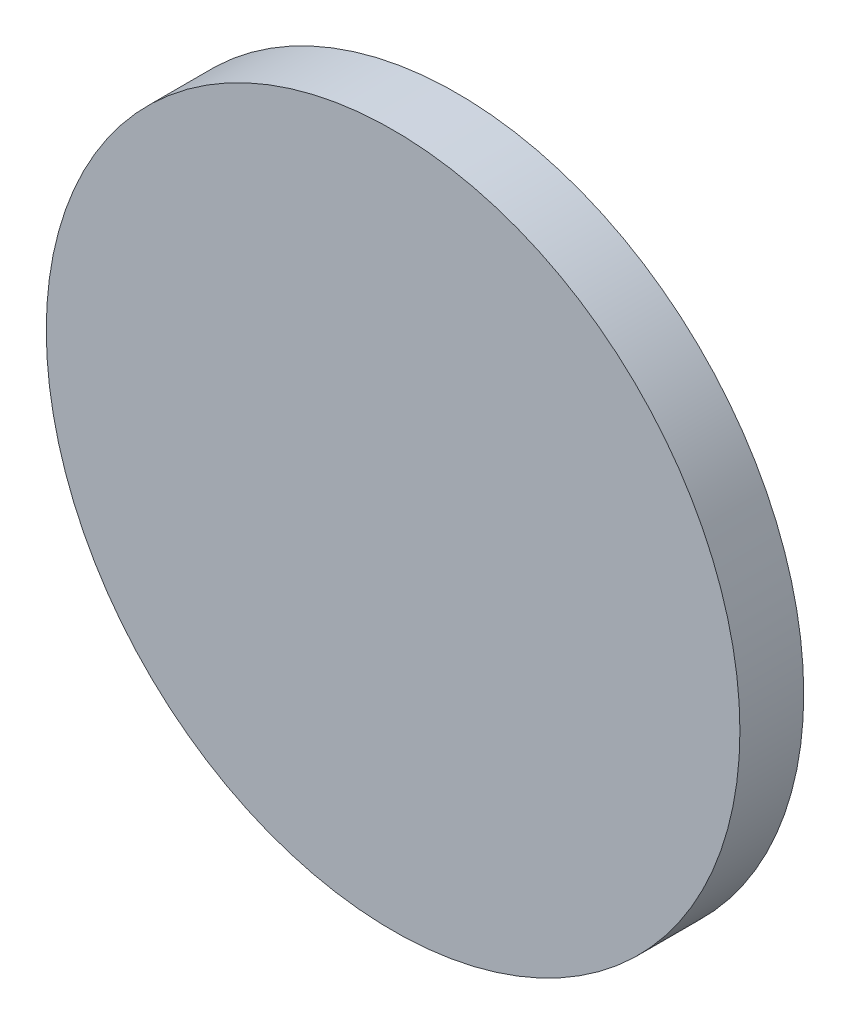
ISO-10303-21;
HEADER;
FILE_DESCRIPTION(('STEP AP214'),'2;1');
FILE_NAME('part.step','',(''),(''),'','','');
FILE_SCHEMA(('AUTOMOTIVE_DESIGN { 1 0 10303 214 1 1 1 1 }'));
ENDSEC;
DATA;
#1=APPLICATION_CONTEXT('core data for automotive mechanical design processes');
#2=APPLICATION_PROTOCOL_DEFINITION('international standard','automotive_design',2000,#1);
#3=PRODUCT_CONTEXT('',#1,'mechanical');
#4=PRODUCT('Part','Part','',(#3));
#5=PRODUCT_RELATED_PRODUCT_CATEGORY('part','',(#4));
#6=PRODUCT_DEFINITION_FORMATION('','',#4);
#7=PRODUCT_DEFINITION_CONTEXT('part definition',#1,'design');
#8=PRODUCT_DEFINITION('design','',#6,#7);
#9=PRODUCT_DEFINITION_SHAPE('','',#8);
#10=(LENGTH_UNIT() NAMED_UNIT(*) SI_UNIT(.MILLI.,.METRE.));
#11=(NAMED_UNIT(*) PLANE_ANGLE_UNIT() SI_UNIT($,.RADIAN.));
#12=(NAMED_UNIT(*) SI_UNIT($,.STERADIAN.) SOLID_ANGLE_UNIT());
#13=UNCERTAINTY_MEASURE_WITH_UNIT(LENGTH_MEASURE(1.E-05),#10,'distance_accuracy_value','');
#14=(GEOMETRIC_REPRESENTATION_CONTEXT(3) GLOBAL_UNCERTAINTY_ASSIGNED_CONTEXT((#13)) GLOBAL_UNIT_ASSIGNED_CONTEXT((#10,
#11,#12)) REPRESENTATION_CONTEXT('',''));
#15=CARTESIAN_POINT('',(0.,0.,0.));
#16=DIRECTION('',(0.,0.,1.));
#17=DIRECTION('',(1.,0.,0.));
#18=AXIS2_PLACEMENT_3D('',#15,#16,#17);
#19=CARTESIAN_POINT('',(101.247935775885,61.5632418345266,2.3));
#20=DIRECTION('',(0.,0.,-1.));
#21=DIRECTION('',(-1.,0.,0.));
#22=AXIS2_PLACEMENT_3D('',#19,#20,#21);
#23=CYLINDRICAL_SURFACE('',#22,12.5);
#24=CARTESIAN_POINT('',(101.247935775885,61.5632418345266,2.3));
#25=DIRECTION('',(0.,0.,1.));
#26=DIRECTION('',(1.,0.,0.));
#27=AXIS2_PLACEMENT_3D('',#24,#25,#26);
#28=CIRCLE('',#27,12.5);
#29=CARTESIAN_POINT('',(113.747935775885,61.5632418345266,2.3));
#30=VERTEX_POINT('',#29);
#31=EDGE_CURVE('E10',#30,#30,#28,.T.);
#32=ORIENTED_EDGE('',*,*,#31,.F.);
#33=EDGE_LOOP('',(#32));
#34=FACE_BOUND('',#33,.T.);
#35=CARTESIAN_POINT('',(101.247935775885,61.5632418345266,0.));
#36=DIRECTION('',(0.,0.,1.));
#37=DIRECTION('',(1.,0.,0.));
#38=AXIS2_PLACEMENT_3D('',#35,#36,#37);
#39=CIRCLE('',#38,12.5);
#40=CARTESIAN_POINT('',(113.747935775885,61.5632418345266,0.));
#41=VERTEX_POINT('',#40);
#42=EDGE_CURVE('E38',#41,#41,#39,.T.);
#43=ORIENTED_EDGE('',*,*,#42,.T.);
#44=EDGE_LOOP('',(#43));
#45=FACE_BOUND('',#44,.T.);
#46=ADVANCED_FACE('F35',(#34,#45),#23,.T.);
#47=CARTESIAN_POINT('',(101.247935775885,61.5632418345266,2.3));
#48=DIRECTION('',(0.,0.,1.));
#49=DIRECTION('',(1.,0.,0.));
#50=AXIS2_PLACEMENT_3D('',#47,#48,#49);
#51=PLANE('',#50);
#52=ORIENTED_EDGE('',*,*,#31,.T.);
#53=EDGE_LOOP('',(#52));
#54=FACE_BOUND('',#53,.T.);
#55=ADVANCED_FACE('F50',(#54),#51,.T.);
#56=CARTESIAN_POINT('',(101.247935775885,61.5632418345266,0.));
#57=DIRECTION('',(0.,0.,1.));
#58=DIRECTION('',(1.,0.,0.));
#59=AXIS2_PLACEMENT_3D('',#56,#57,#58);
#60=PLANE('',#59);
#61=ORIENTED_EDGE('',*,*,#42,.F.);
#62=EDGE_LOOP('',(#61));
#63=FACE_BOUND('',#62,.T.);
#64=ADVANCED_FACE('F48',(#63),#60,.F.);
#65=CLOSED_SHELL('',(#46,#55,#64));
#66=MANIFOLD_SOLID_BREP('B2',#65);
#67=ADVANCED_BREP_SHAPE_REPRESENTATION('',(#18,#66),#14);
#68=SHAPE_DEFINITION_REPRESENTATION(#9,#67);
ENDSEC;
END-ISO-10303-21;
